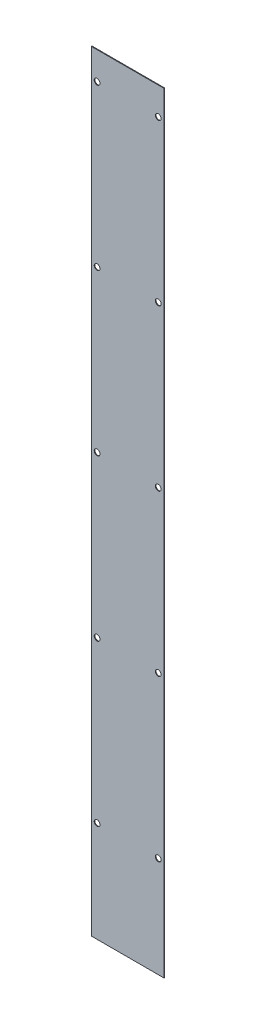
ISO-10303-21;
HEADER;
FILE_DESCRIPTION(('STEP AP214'),'2;1');
FILE_NAME('part.step','',(''),(''),'','','');
FILE_SCHEMA(('AUTOMOTIVE_DESIGN { 1 0 10303 214 1 1 1 1 }'));
ENDSEC;
DATA;
#1=APPLICATION_CONTEXT('core data for automotive mechanical design processes');
#2=APPLICATION_PROTOCOL_DEFINITION('international standard','automotive_design',2000,#1);
#3=PRODUCT_CONTEXT('',#1,'mechanical');
#4=PRODUCT('Part','Part','',(#3));
#5=PRODUCT_RELATED_PRODUCT_CATEGORY('part','',(#4));
#6=PRODUCT_DEFINITION_FORMATION('','',#4);
#7=PRODUCT_DEFINITION_CONTEXT('part definition',#1,'design');
#8=PRODUCT_DEFINITION('design','',#6,#7);
#9=PRODUCT_DEFINITION_SHAPE('','',#8);
#10=(LENGTH_UNIT() NAMED_UNIT(*) SI_UNIT(.MILLI.,.METRE.));
#11=(NAMED_UNIT(*) PLANE_ANGLE_UNIT() SI_UNIT($,.RADIAN.));
#12=(NAMED_UNIT(*) SI_UNIT($,.STERADIAN.) SOLID_ANGLE_UNIT());
#13=UNCERTAINTY_MEASURE_WITH_UNIT(LENGTH_MEASURE(1.E-05),#10,'distance_accuracy_value','');
#14=(GEOMETRIC_REPRESENTATION_CONTEXT(3) GLOBAL_UNCERTAINTY_ASSIGNED_CONTEXT((#13)) GLOBAL_UNIT_ASSIGNED_CONTEXT((#10,
#11,#12)) REPRESENTATION_CONTEXT('',''));
#15=CARTESIAN_POINT('',(0.,0.,0.));
#16=DIRECTION('',(0.,0.,1.));
#17=DIRECTION('',(1.,0.,0.));
#18=AXIS2_PLACEMENT_3D('',#15,#16,#17);
#19=CARTESIAN_POINT('',(0.,0.,-0.7));
#20=DIRECTION('',(-1.,0.,0.));
#21=DIRECTION('',(0.,0.,1.));
#22=AXIS2_PLACEMENT_3D('',#19,#20,#21);
#23=PLANE('',#22);
#24=DIRECTION('',(0.,-1.,0.));
#25=VECTOR('',#24,1.);
#26=CARTESIAN_POINT('',(0.,0.,0.));
#27=LINE('',#26,#25);
#28=CARTESIAN_POINT('',(0.,806.5,0.));
#29=VERTEX_POINT('',#28);
#30=CARTESIAN_POINT('',(0.,0.,0.));
#31=VERTEX_POINT('',#30);
#32=EDGE_CURVE('E103',#29,#31,#27,.T.);
#33=ORIENTED_EDGE('',*,*,#32,.F.);
#34=DIRECTION('',(0.,0.,1.));
#35=VECTOR('',#34,1.);
#36=CARTESIAN_POINT('',(0.,806.5,-0.7));
#37=LINE('',#36,#35);
#38=CARTESIAN_POINT('',(0.,806.5,-0.7));
#39=VERTEX_POINT('',#38);
#40=EDGE_CURVE('E11',#39,#29,#37,.T.);
#41=ORIENTED_EDGE('',*,*,#40,.F.);
#42=DIRECTION('',(0.,-1.,0.));
#43=VECTOR('',#42,1.);
#44=CARTESIAN_POINT('',(0.,0.,-0.7));
#45=LINE('',#44,#43);
#46=CARTESIAN_POINT('',(0.,0.,-0.7));
#47=VERTEX_POINT('',#46);
#48=EDGE_CURVE('E96',#39,#47,#45,.T.);
#49=ORIENTED_EDGE('',*,*,#48,.T.);
#50=DIRECTION('',(0.,0.,1.));
#51=VECTOR('',#50,1.);
#52=CARTESIAN_POINT('',(0.,0.,-0.7));
#53=LINE('',#52,#51);
#54=EDGE_CURVE('E41',#47,#31,#53,.T.);
#55=ORIENTED_EDGE('',*,*,#54,.T.);
#56=EDGE_LOOP('',(#33,#41,#49,#55));
#57=FACE_BOUND('',#56,.T.);
#58=ADVANCED_FACE('F38',(#57),#23,.T.);
#59=CARTESIAN_POINT('',(0.,806.5,-0.7));
#60=DIRECTION('',(0.,1.,0.));
#61=DIRECTION('',(0.,0.,1.));
#62=AXIS2_PLACEMENT_3D('',#59,#60,#61);
#63=PLANE('',#62);
#64=DIRECTION('',(-1.,0.,0.));
#65=VECTOR('',#64,1.);
#66=CARTESIAN_POINT('',(0.,806.5,0.));
#67=LINE('',#66,#65);
#68=CARTESIAN_POINT('',(76.,806.5,0.));
#69=VERTEX_POINT('',#68);
#70=EDGE_CURVE('E98',#69,#29,#67,.T.);
#71=ORIENTED_EDGE('',*,*,#70,.F.);
#72=DIRECTION('',(0.,0.,1.));
#73=VECTOR('',#72,1.);
#74=CARTESIAN_POINT('',(76.,806.5,-0.7));
#75=LINE('',#74,#73);
#76=CARTESIAN_POINT('',(76.,806.5,-0.7));
#77=VERTEX_POINT('',#76);
#78=EDGE_CURVE('E47',#77,#69,#75,.T.);
#79=ORIENTED_EDGE('',*,*,#78,.F.);
#80=DIRECTION('',(-1.,0.,0.));
#81=VECTOR('',#80,1.);
#82=CARTESIAN_POINT('',(0.,806.5,-0.7));
#83=LINE('',#82,#81);
#84=EDGE_CURVE('E93',#77,#39,#83,.T.);
#85=ORIENTED_EDGE('',*,*,#84,.T.);
#86=ORIENTED_EDGE('',*,*,#40,.T.);
#87=EDGE_LOOP('',(#71,#79,#85,#86));
#88=FACE_BOUND('',#87,.T.);
#89=ADVANCED_FACE('F114',(#88),#63,.T.);
#90=CARTESIAN_POINT('',(76.,0.,-0.7));
#91=DIRECTION('',(1.,0.,0.));
#92=DIRECTION('',(0.,0.,-1.));
#93=AXIS2_PLACEMENT_3D('',#90,#91,#92);
#94=PLANE('',#93);
#95=DIRECTION('',(0.,1.,0.));
#96=VECTOR('',#95,1.);
#97=CARTESIAN_POINT('',(76.,0.,0.));
#98=LINE('',#97,#96);
#99=CARTESIAN_POINT('',(76.,0.,0.));
#100=VERTEX_POINT('',#99);
#101=EDGE_CURVE('E88',#100,#69,#98,.T.);
#102=ORIENTED_EDGE('',*,*,#101,.F.);
#103=DIRECTION('',(0.,0.,1.));
#104=VECTOR('',#103,1.);
#105=CARTESIAN_POINT('',(76.,0.,-0.7));
#106=LINE('',#105,#104);
#107=CARTESIAN_POINT('',(76.,0.,-0.7));
#108=VERTEX_POINT('',#107);
#109=EDGE_CURVE('E83',#108,#100,#106,.T.);
#110=ORIENTED_EDGE('',*,*,#109,.F.);
#111=DIRECTION('',(0.,1.,0.));
#112=VECTOR('',#111,1.);
#113=CARTESIAN_POINT('',(76.,0.,-0.7));
#114=LINE('',#113,#112);
#115=EDGE_CURVE('E86',#108,#77,#114,.T.);
#116=ORIENTED_EDGE('',*,*,#115,.T.);
#117=ORIENTED_EDGE('',*,*,#78,.T.);
#118=EDGE_LOOP('',(#102,#110,#116,#117));
#119=FACE_BOUND('',#118,.T.);
#120=ADVANCED_FACE('F85',(#119),#94,.T.);
#121=CARTESIAN_POINT('',(0.,0.,-0.7));
#122=DIRECTION('',(0.,-1.,0.));
#123=DIRECTION('',(0.,0.,-1.));
#124=AXIS2_PLACEMENT_3D('',#121,#122,#123);
#125=PLANE('',#124);
#126=DIRECTION('',(1.,0.,0.));
#127=VECTOR('',#126,1.);
#128=CARTESIAN_POINT('',(0.,0.,0.));
#129=LINE('',#128,#127);
#130=EDGE_CURVE('E106',#31,#100,#129,.T.);
#131=ORIENTED_EDGE('',*,*,#130,.F.);
#132=ORIENTED_EDGE('',*,*,#54,.F.);
#133=DIRECTION('',(1.,0.,0.));
#134=VECTOR('',#133,1.);
#135=CARTESIAN_POINT('',(0.,0.,-0.7));
#136=LINE('',#135,#134);
#137=EDGE_CURVE('E92',#47,#108,#136,.T.);
#138=ORIENTED_EDGE('',*,*,#137,.T.);
#139=ORIENTED_EDGE('',*,*,#109,.T.);
#140=EDGE_LOOP('',(#131,#132,#138,#139));
#141=FACE_BOUND('',#140,.T.);
#142=ADVANCED_FACE('F95',(#141),#125,.T.);
#143=CARTESIAN_POINT('',(0.,0.,-0.7));
#144=DIRECTION('',(0.,0.,-1.));
#145=DIRECTION('',(-1.,0.,0.));
#146=AXIS2_PLACEMENT_3D('',#143,#144,#145);
#147=PLANE('',#146);
#148=CARTESIAN_POINT('',(6.00000000000002,777.5,-0.699999999999999));
#149=DIRECTION('',(0.,0.,-1.));
#150=DIRECTION('',(-1.,0.,0.));
#151=AXIS2_PLACEMENT_3D('',#148,#149,#150);
#152=CIRCLE('',#151,3.00000000000001);
#153=CARTESIAN_POINT('',(3.00000000000001,777.5,-0.699999999999999));
#154=VERTEX_POINT('',#153);
#155=EDGE_CURVE('E107',#154,#154,#152,.T.);
#156=ORIENTED_EDGE('',*,*,#155,.F.);
#157=EDGE_LOOP('',(#156));
#158=FACE_BOUND('',#157,.T.);
#159=CARTESIAN_POINT('',(5.99999999999828,609.5,-0.699999999999999));
#160=DIRECTION('',(0.,0.,-1.));
#161=DIRECTION('',(-1.,0.,0.));
#162=AXIS2_PLACEMENT_3D('',#159,#160,#161);
#163=CIRCLE('',#162,3.00000000000001);
#164=CARTESIAN_POINT('',(2.99999999999828,609.5,-0.699999999999999));
#165=VERTEX_POINT('',#164);
#166=EDGE_CURVE('E236',#165,#165,#163,.T.);
#167=ORIENTED_EDGE('',*,*,#166,.F.);
#168=EDGE_LOOP('',(#167));
#169=FACE_BOUND('',#168,.T.);
#170=CARTESIAN_POINT('',(5.99999999999656,441.5,-0.699999999999999));
#171=DIRECTION('',(0.,0.,-1.));
#172=DIRECTION('',(-1.,0.,0.));
#173=AXIS2_PLACEMENT_3D('',#170,#171,#172);
#174=CIRCLE('',#173,3.00000000000001);
#175=CARTESIAN_POINT('',(2.99999999999656,441.5,-0.699999999999999));
#176=VERTEX_POINT('',#175);
#177=EDGE_CURVE('E233',#176,#176,#174,.T.);
#178=ORIENTED_EDGE('',*,*,#177,.F.);
#179=EDGE_LOOP('',(#178));
#180=FACE_BOUND('',#179,.T.);
#181=CARTESIAN_POINT('',(5.99999999999486,273.5,-0.699999999999999));
#182=DIRECTION('',(0.,0.,-1.));
#183=DIRECTION('',(-1.,0.,0.));
#184=AXIS2_PLACEMENT_3D('',#181,#182,#183);
#185=CIRCLE('',#184,3.00000000000001);
#186=CARTESIAN_POINT('',(2.99999999999485,273.5,-0.699999999999999));
#187=VERTEX_POINT('',#186);
#188=EDGE_CURVE('E230',#187,#187,#185,.T.);
#189=ORIENTED_EDGE('',*,*,#188,.F.);
#190=EDGE_LOOP('',(#189));
#191=FACE_BOUND('',#190,.T.);
#192=CARTESIAN_POINT('',(5.99999999999314,105.5,-0.699999999999999));
#193=DIRECTION('',(0.,0.,-1.));
#194=DIRECTION('',(-1.,0.,0.));
#195=AXIS2_PLACEMENT_3D('',#192,#193,#194);
#196=CIRCLE('',#195,3.00000000000001);
#197=CARTESIAN_POINT('',(2.99999999999313,105.5,-0.699999999999999));
#198=VERTEX_POINT('',#197);
#199=EDGE_CURVE('E227',#198,#198,#196,.T.);
#200=ORIENTED_EDGE('',*,*,#199,.F.);
#201=EDGE_LOOP('',(#200));
#202=FACE_BOUND('',#201,.T.);
#203=CARTESIAN_POINT('',(70.000000000007,105.5,-0.699999999999999));
#204=DIRECTION('',(0.,0.,-1.));
#205=DIRECTION('',(-1.,0.,0.));
#206=AXIS2_PLACEMENT_3D('',#203,#204,#205);
#207=CIRCLE('',#206,3.00000000000001);
#208=CARTESIAN_POINT('',(67.000000000007,105.5,-0.699999999999999));
#209=VERTEX_POINT('',#208);
#210=EDGE_CURVE('E224',#209,#209,#207,.T.);
#211=ORIENTED_EDGE('',*,*,#210,.F.);
#212=EDGE_LOOP('',(#211));
#213=FACE_BOUND('',#212,.T.);
#214=CARTESIAN_POINT('',(70.0000000000053,273.5,-0.699999999999999));
#215=DIRECTION('',(0.,0.,-1.));
#216=DIRECTION('',(-1.,0.,0.));
#217=AXIS2_PLACEMENT_3D('',#214,#215,#216);
#218=CIRCLE('',#217,3.00000000000001);
#219=CARTESIAN_POINT('',(67.0000000000053,273.5,-0.699999999999999));
#220=VERTEX_POINT('',#219);
#221=EDGE_CURVE('E221',#220,#220,#218,.T.);
#222=ORIENTED_EDGE('',*,*,#221,.F.);
#223=EDGE_LOOP('',(#222));
#224=FACE_BOUND('',#223,.T.);
#225=CARTESIAN_POINT('',(70.0000000000035,441.5,-0.699999999999999));
#226=DIRECTION('',(0.,0.,-1.));
#227=DIRECTION('',(-1.,0.,0.));
#228=AXIS2_PLACEMENT_3D('',#225,#226,#227);
#229=CIRCLE('',#228,3.00000000000001);
#230=CARTESIAN_POINT('',(67.0000000000035,441.5,-0.699999999999999));
#231=VERTEX_POINT('',#230);
#232=EDGE_CURVE('E218',#231,#231,#229,.T.);
#233=ORIENTED_EDGE('',*,*,#232,.F.);
#234=EDGE_LOOP('',(#233));
#235=FACE_BOUND('',#234,.T.);
#236=CARTESIAN_POINT('',(70.0000000000018,609.5,-0.699999999999999));
#237=DIRECTION('',(0.,0.,-1.));
#238=DIRECTION('',(-1.,0.,0.));
#239=AXIS2_PLACEMENT_3D('',#236,#237,#238);
#240=CIRCLE('',#239,3.00000000000001);
#241=CARTESIAN_POINT('',(67.0000000000017,609.5,-0.699999999999999));
#242=VERTEX_POINT('',#241);
#243=EDGE_CURVE('E180',#242,#242,#240,.T.);
#244=ORIENTED_EDGE('',*,*,#243,.F.);
#245=EDGE_LOOP('',(#244));
#246=FACE_BOUND('',#245,.T.);
#247=CARTESIAN_POINT('',(70.,777.5,-0.699999999999999));
#248=DIRECTION('',(0.,0.,-1.));
#249=DIRECTION('',(-1.,0.,0.));
#250=AXIS2_PLACEMENT_3D('',#247,#248,#249);
#251=CIRCLE('',#250,3.00000000000001);
#252=CARTESIAN_POINT('',(67.,777.5,-0.699999999999999));
#253=VERTEX_POINT('',#252);
#254=EDGE_CURVE('E189',#253,#253,#251,.T.);
#255=ORIENTED_EDGE('',*,*,#254,.F.);
#256=EDGE_LOOP('',(#255));
#257=FACE_BOUND('',#256,.T.);
#258=ORIENTED_EDGE('',*,*,#48,.F.);
#259=ORIENTED_EDGE('',*,*,#84,.F.);
#260=ORIENTED_EDGE('',*,*,#115,.F.);
#261=ORIENTED_EDGE('',*,*,#137,.F.);
#262=EDGE_LOOP('',(#258,#259,#260,#261));
#263=FACE_BOUND('',#262,.T.);
#264=ADVANCED_FACE('F91',(#158,#169,#180,#191,#202,#213,#224,#235,#246,#257,#263),#147,.T.);
#265=CARTESIAN_POINT('',(0.,0.,0.));
#266=DIRECTION('',(0.,0.,-1.));
#267=DIRECTION('',(-1.,0.,0.));
#268=AXIS2_PLACEMENT_3D('',#265,#266,#267);
#269=PLANE('',#268);
#270=CARTESIAN_POINT('',(6.00000000000002,777.5,0.));
#271=DIRECTION('',(0.,0.,1.));
#272=DIRECTION('',(-1.,0.,0.));
#273=AXIS2_PLACEMENT_3D('',#270,#271,#272);
#274=CIRCLE('',#273,3.00000000000001);
#275=CARTESIAN_POINT('',(3.00000000000001,777.5,0.));
#276=VERTEX_POINT('',#275);
#277=EDGE_CURVE('E212',#276,#276,#274,.T.);
#278=ORIENTED_EDGE('',*,*,#277,.F.);
#279=EDGE_LOOP('',(#278));
#280=FACE_BOUND('',#279,.T.);
#281=CARTESIAN_POINT('',(5.99999999999828,609.5,0.));
#282=DIRECTION('',(0.,0.,1.));
#283=DIRECTION('',(-1.,0.,0.));
#284=AXIS2_PLACEMENT_3D('',#281,#282,#283);
#285=CIRCLE('',#284,3.00000000000001);
#286=CARTESIAN_POINT('',(2.99999999999828,609.5,0.));
#287=VERTEX_POINT('',#286);
#288=EDGE_CURVE('E209',#287,#287,#285,.T.);
#289=ORIENTED_EDGE('',*,*,#288,.F.);
#290=EDGE_LOOP('',(#289));
#291=FACE_BOUND('',#290,.T.);
#292=CARTESIAN_POINT('',(5.99999999999656,441.5,0.));
#293=DIRECTION('',(0.,0.,1.));
#294=DIRECTION('',(-1.,0.,0.));
#295=AXIS2_PLACEMENT_3D('',#292,#293,#294);
#296=CIRCLE('',#295,3.00000000000001);
#297=CARTESIAN_POINT('',(2.99999999999656,441.5,0.));
#298=VERTEX_POINT('',#297);
#299=EDGE_CURVE('E206',#298,#298,#296,.T.);
#300=ORIENTED_EDGE('',*,*,#299,.F.);
#301=EDGE_LOOP('',(#300));
#302=FACE_BOUND('',#301,.T.);
#303=CARTESIAN_POINT('',(5.99999999999486,273.5,0.));
#304=DIRECTION('',(0.,0.,1.));
#305=DIRECTION('',(-1.,0.,0.));
#306=AXIS2_PLACEMENT_3D('',#303,#304,#305);
#307=CIRCLE('',#306,3.00000000000001);
#308=CARTESIAN_POINT('',(2.99999999999485,273.5,0.));
#309=VERTEX_POINT('',#308);
#310=EDGE_CURVE('E203',#309,#309,#307,.T.);
#311=ORIENTED_EDGE('',*,*,#310,.F.);
#312=EDGE_LOOP('',(#311));
#313=FACE_BOUND('',#312,.T.);
#314=CARTESIAN_POINT('',(5.99999999999314,105.5,0.));
#315=DIRECTION('',(0.,0.,1.));
#316=DIRECTION('',(-1.,0.,0.));
#317=AXIS2_PLACEMENT_3D('',#314,#315,#316);
#318=CIRCLE('',#317,3.00000000000001);
#319=CARTESIAN_POINT('',(2.99999999999313,105.5,0.));
#320=VERTEX_POINT('',#319);
#321=EDGE_CURVE('E200',#320,#320,#318,.T.);
#322=ORIENTED_EDGE('',*,*,#321,.F.);
#323=EDGE_LOOP('',(#322));
#324=FACE_BOUND('',#323,.T.);
#325=CARTESIAN_POINT('',(70.000000000007,105.5,0.));
#326=DIRECTION('',(0.,0.,1.));
#327=DIRECTION('',(1.,0.,0.));
#328=AXIS2_PLACEMENT_3D('',#325,#326,#327);
#329=CIRCLE('',#328,3.00000000000001);
#330=CARTESIAN_POINT('',(73.000000000007,105.5,0.));
#331=VERTEX_POINT('',#330);
#332=EDGE_CURVE('E197',#331,#331,#329,.T.);
#333=ORIENTED_EDGE('',*,*,#332,.F.);
#334=EDGE_LOOP('',(#333));
#335=FACE_BOUND('',#334,.T.);
#336=CARTESIAN_POINT('',(70.0000000000053,273.5,0.));
#337=DIRECTION('',(0.,0.,1.));
#338=DIRECTION('',(1.,0.,0.));
#339=AXIS2_PLACEMENT_3D('',#336,#337,#338);
#340=CIRCLE('',#339,3.00000000000001);
#341=CARTESIAN_POINT('',(73.0000000000053,273.5,0.));
#342=VERTEX_POINT('',#341);
#343=EDGE_CURVE('E192',#342,#342,#340,.T.);
#344=ORIENTED_EDGE('',*,*,#343,.F.);
#345=EDGE_LOOP('',(#344));
#346=FACE_BOUND('',#345,.T.);
#347=CARTESIAN_POINT('',(70.0000000000035,441.5,0.));
#348=DIRECTION('',(0.,0.,1.));
#349=DIRECTION('',(1.,0.,0.));
#350=AXIS2_PLACEMENT_3D('',#347,#348,#349);
#351=CIRCLE('',#350,3.00000000000001);
#352=CARTESIAN_POINT('',(73.0000000000035,441.5,0.));
#353=VERTEX_POINT('',#352);
#354=EDGE_CURVE('E186',#353,#353,#351,.T.);
#355=ORIENTED_EDGE('',*,*,#354,.F.);
#356=EDGE_LOOP('',(#355));
#357=FACE_BOUND('',#356,.T.);
#358=CARTESIAN_POINT('',(70.0000000000018,609.5,0.));
#359=DIRECTION('',(0.,0.,1.));
#360=DIRECTION('',(1.,0.,0.));
#361=AXIS2_PLACEMENT_3D('',#358,#359,#360);
#362=CIRCLE('',#361,3.00000000000001);
#363=CARTESIAN_POINT('',(73.0000000000018,609.5,0.));
#364=VERTEX_POINT('',#363);
#365=EDGE_CURVE('E183',#364,#364,#362,.T.);
#366=ORIENTED_EDGE('',*,*,#365,.F.);
#367=EDGE_LOOP('',(#366));
#368=FACE_BOUND('',#367,.T.);
#369=CARTESIAN_POINT('',(70.,777.5,0.));
#370=DIRECTION('',(0.,0.,1.));
#371=DIRECTION('',(1.,0.,0.));
#372=AXIS2_PLACEMENT_3D('',#369,#370,#371);
#373=CIRCLE('',#372,3.00000000000001);
#374=CARTESIAN_POINT('',(73.,777.5,0.));
#375=VERTEX_POINT('',#374);
#376=EDGE_CURVE('E185',#375,#375,#373,.T.);
#377=ORIENTED_EDGE('',*,*,#376,.F.);
#378=EDGE_LOOP('',(#377));
#379=FACE_BOUND('',#378,.T.);
#380=ORIENTED_EDGE('',*,*,#32,.T.);
#381=ORIENTED_EDGE('',*,*,#130,.T.);
#382=ORIENTED_EDGE('',*,*,#101,.T.);
#383=ORIENTED_EDGE('',*,*,#70,.T.);
#384=EDGE_LOOP('',(#380,#381,#382,#383));
#385=FACE_BOUND('',#384,.T.);
#386=ADVANCED_FACE('F113',(#280,#291,#302,#313,#324,#335,#346,#357,#368,#379,#385),#269,.F.);
#387=CARTESIAN_POINT('',(70.,777.5,-10.));
#388=DIRECTION('',(0.,0.,1.));
#389=DIRECTION('',(1.,0.,0.));
#390=AXIS2_PLACEMENT_3D('',#387,#388,#389);
#391=CYLINDRICAL_SURFACE('',#390,3.00000000000001);
#392=ORIENTED_EDGE('',*,*,#254,.T.);
#393=EDGE_LOOP('',(#392));
#394=FACE_BOUND('',#393,.T.);
#395=ORIENTED_EDGE('',*,*,#376,.T.);
#396=EDGE_LOOP('',(#395));
#397=FACE_BOUND('',#396,.T.);
#398=ADVANCED_FACE('F132',(#394,#397),#391,.F.);
#399=CARTESIAN_POINT('',(70.0000000000018,609.5,-10.));
#400=DIRECTION('',(0.,0.,1.));
#401=DIRECTION('',(1.,0.,0.));
#402=AXIS2_PLACEMENT_3D('',#399,#400,#401);
#403=CYLINDRICAL_SURFACE('',#402,3.00000000000001);
#404=ORIENTED_EDGE('',*,*,#243,.T.);
#405=EDGE_LOOP('',(#404));
#406=FACE_BOUND('',#405,.T.);
#407=ORIENTED_EDGE('',*,*,#365,.T.);
#408=EDGE_LOOP('',(#407));
#409=FACE_BOUND('',#408,.T.);
#410=ADVANCED_FACE('F139',(#406,#409),#403,.F.);
#411=CARTESIAN_POINT('',(70.0000000000035,441.5,-10.));
#412=DIRECTION('',(0.,0.,1.));
#413=DIRECTION('',(1.,0.,0.));
#414=AXIS2_PLACEMENT_3D('',#411,#412,#413);
#415=CYLINDRICAL_SURFACE('',#414,3.00000000000001);
#416=ORIENTED_EDGE('',*,*,#232,.T.);
#417=EDGE_LOOP('',(#416));
#418=FACE_BOUND('',#417,.T.);
#419=ORIENTED_EDGE('',*,*,#354,.T.);
#420=EDGE_LOOP('',(#419));
#421=FACE_BOUND('',#420,.T.);
#422=ADVANCED_FACE('F168',(#418,#421),#415,.F.);
#423=CARTESIAN_POINT('',(70.0000000000053,273.5,-10.));
#424=DIRECTION('',(0.,0.,1.));
#425=DIRECTION('',(1.,0.,0.));
#426=AXIS2_PLACEMENT_3D('',#423,#424,#425);
#427=CYLINDRICAL_SURFACE('',#426,3.00000000000001);
#428=ORIENTED_EDGE('',*,*,#221,.T.);
#429=EDGE_LOOP('',(#428));
#430=FACE_BOUND('',#429,.T.);
#431=ORIENTED_EDGE('',*,*,#343,.T.);
#432=EDGE_LOOP('',(#431));
#433=FACE_BOUND('',#432,.T.);
#434=ADVANCED_FACE('F164',(#430,#433),#427,.F.);
#435=CARTESIAN_POINT('',(70.000000000007,105.5,-10.));
#436=DIRECTION('',(0.,0.,1.));
#437=DIRECTION('',(1.,0.,0.));
#438=AXIS2_PLACEMENT_3D('',#435,#436,#437);
#439=CYLINDRICAL_SURFACE('',#438,3.00000000000001);
#440=ORIENTED_EDGE('',*,*,#210,.T.);
#441=EDGE_LOOP('',(#440));
#442=FACE_BOUND('',#441,.T.);
#443=ORIENTED_EDGE('',*,*,#332,.T.);
#444=EDGE_LOOP('',(#443));
#445=FACE_BOUND('',#444,.T.);
#446=ADVANCED_FACE('F160',(#442,#445),#439,.F.);
#447=CARTESIAN_POINT('',(5.99999999999314,105.5,-10.));
#448=DIRECTION('',(0.,0.,1.));
#449=DIRECTION('',(1.,0.,0.));
#450=AXIS2_PLACEMENT_3D('',#447,#448,#449);
#451=CYLINDRICAL_SURFACE('',#450,3.00000000000001);
#452=ORIENTED_EDGE('',*,*,#199,.T.);
#453=EDGE_LOOP('',(#452));
#454=FACE_BOUND('',#453,.T.);
#455=ORIENTED_EDGE('',*,*,#321,.T.);
#456=EDGE_LOOP('',(#455));
#457=FACE_BOUND('',#456,.T.);
#458=ADVANCED_FACE('F156',(#454,#457),#451,.F.);
#459=CARTESIAN_POINT('',(5.99999999999486,273.5,-10.));
#460=DIRECTION('',(0.,0.,1.));
#461=DIRECTION('',(1.,0.,0.));
#462=AXIS2_PLACEMENT_3D('',#459,#460,#461);
#463=CYLINDRICAL_SURFACE('',#462,3.00000000000001);
#464=ORIENTED_EDGE('',*,*,#188,.T.);
#465=EDGE_LOOP('',(#464));
#466=FACE_BOUND('',#465,.T.);
#467=ORIENTED_EDGE('',*,*,#310,.T.);
#468=EDGE_LOOP('',(#467));
#469=FACE_BOUND('',#468,.T.);
#470=ADVANCED_FACE('F152',(#466,#469),#463,.F.);
#471=CARTESIAN_POINT('',(5.99999999999656,441.5,-10.));
#472=DIRECTION('',(0.,0.,1.));
#473=DIRECTION('',(1.,0.,0.));
#474=AXIS2_PLACEMENT_3D('',#471,#472,#473);
#475=CYLINDRICAL_SURFACE('',#474,3.00000000000001);
#476=ORIENTED_EDGE('',*,*,#177,.T.);
#477=EDGE_LOOP('',(#476));
#478=FACE_BOUND('',#477,.T.);
#479=ORIENTED_EDGE('',*,*,#299,.T.);
#480=EDGE_LOOP('',(#479));
#481=FACE_BOUND('',#480,.T.);
#482=ADVANCED_FACE('F148',(#478,#481),#475,.F.);
#483=CARTESIAN_POINT('',(5.99999999999828,609.5,-10.));
#484=DIRECTION('',(0.,0.,1.));
#485=DIRECTION('',(1.,0.,0.));
#486=AXIS2_PLACEMENT_3D('',#483,#484,#485);
#487=CYLINDRICAL_SURFACE('',#486,3.00000000000001);
#488=ORIENTED_EDGE('',*,*,#166,.T.);
#489=EDGE_LOOP('',(#488));
#490=FACE_BOUND('',#489,.T.);
#491=ORIENTED_EDGE('',*,*,#288,.T.);
#492=EDGE_LOOP('',(#491));
#493=FACE_BOUND('',#492,.T.);
#494=ADVANCED_FACE('F144',(#490,#493),#487,.F.);
#495=CARTESIAN_POINT('',(6.00000000000002,777.5,-10.));
#496=DIRECTION('',(0.,0.,1.));
#497=DIRECTION('',(1.,0.,0.));
#498=AXIS2_PLACEMENT_3D('',#495,#496,#497);
#499=CYLINDRICAL_SURFACE('',#498,3.00000000000001);
#500=ORIENTED_EDGE('',*,*,#155,.T.);
#501=EDGE_LOOP('',(#500));
#502=FACE_BOUND('',#501,.T.);
#503=ORIENTED_EDGE('',*,*,#277,.T.);
#504=EDGE_LOOP('',(#503));
#505=FACE_BOUND('',#504,.T.);
#506=ADVANCED_FACE('F141',(#502,#505),#499,.F.);
#507=CLOSED_SHELL('',(#58,#89,#120,#142,#264,#386,#398,#410,#422,#434,#446,#458,#470,#482,#494,#506));
#508=MANIFOLD_SOLID_BREP('B2',#507);
#509=ADVANCED_BREP_SHAPE_REPRESENTATION('',(#18,#508),#14);
#510=SHAPE_DEFINITION_REPRESENTATION(#9,#509);
ENDSEC;
END-ISO-10303-21;
